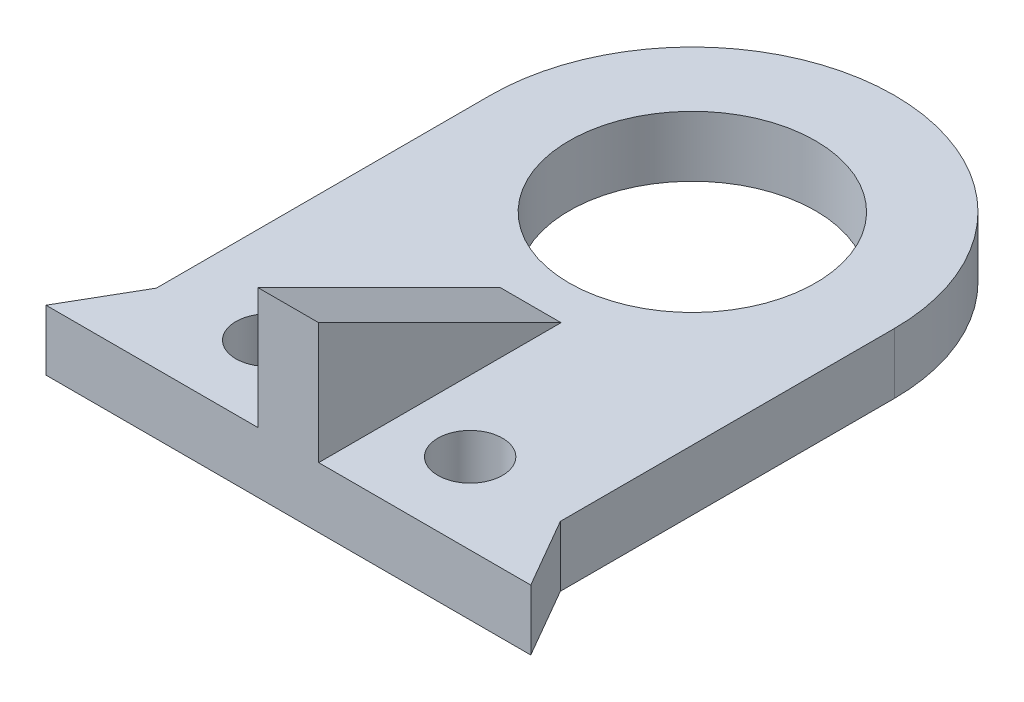
ISO-10303-21;
HEADER;
FILE_DESCRIPTION(('STEP AP214'),'2;1');
FILE_NAME('part.step','',(''),(''),'','','');
FILE_SCHEMA(('AUTOMOTIVE_DESIGN { 1 0 10303 214 1 1 1 1 }'));
ENDSEC;
DATA;
#1=APPLICATION_CONTEXT('core data for automotive mechanical design processes');
#2=APPLICATION_PROTOCOL_DEFINITION('international standard','automotive_design',2000,#1);
#3=PRODUCT_CONTEXT('',#1,'mechanical');
#4=PRODUCT('Part','Part','',(#3));
#5=PRODUCT_RELATED_PRODUCT_CATEGORY('part','',(#4));
#6=PRODUCT_DEFINITION_FORMATION('','',#4);
#7=PRODUCT_DEFINITION_CONTEXT('part definition',#1,'design');
#8=PRODUCT_DEFINITION('design','',#6,#7);
#9=PRODUCT_DEFINITION_SHAPE('','',#8);
#10=(LENGTH_UNIT() NAMED_UNIT(*) SI_UNIT(.MILLI.,.METRE.));
#11=(NAMED_UNIT(*) PLANE_ANGLE_UNIT() SI_UNIT($,.RADIAN.));
#12=(NAMED_UNIT(*) SI_UNIT($,.STERADIAN.) SOLID_ANGLE_UNIT());
#13=UNCERTAINTY_MEASURE_WITH_UNIT(LENGTH_MEASURE(1.E-05),#10,'distance_accuracy_value','');
#14=(GEOMETRIC_REPRESENTATION_CONTEXT(3) GLOBAL_UNCERTAINTY_ASSIGNED_CONTEXT((#13)) GLOBAL_UNIT_ASSIGNED_CONTEXT((#10,
#11,#12)) REPRESENTATION_CONTEXT('',''));
#15=CARTESIAN_POINT('',(0.,0.,0.));
#16=DIRECTION('',(0.,0.,1.));
#17=DIRECTION('',(1.,0.,0.));
#18=AXIS2_PLACEMENT_3D('',#15,#16,#17);
#19=CARTESIAN_POINT('',(10.,3.,10.));
#20=DIRECTION('',(-1.,0.,0.));
#21=DIRECTION('',(0.,0.,1.));
#22=AXIS2_PLACEMENT_3D('',#19,#20,#21);
#23=PLANE('',#22);
#24=DIRECTION('',(0.,-1.,0.));
#25=VECTOR('',#24,1.);
#26=CARTESIAN_POINT('',(10.,3.,6.53589838486228));
#27=LINE('',#26,#25);
#28=CARTESIAN_POINT('',(10.,3.,6.53589838486228));
#29=VERTEX_POINT('',#28);
#30=CARTESIAN_POINT('',(10.,0.,6.53589838486228));
#31=VERTEX_POINT('',#30);
#32=EDGE_CURVE('E125',#29,#31,#27,.T.);
#33=ORIENTED_EDGE('',*,*,#32,.T.);
#34=DIRECTION('',(0.,0.,-1.));
#35=VECTOR('',#34,1.);
#36=CARTESIAN_POINT('',(10.,0.,10.));
#37=LINE('',#36,#35);
#38=CARTESIAN_POINT('',(10.,0.,-10.));
#39=VERTEX_POINT('',#38);
#40=EDGE_CURVE('E182',#31,#39,#37,.T.);
#41=ORIENTED_EDGE('',*,*,#40,.T.);
#42=DIRECTION('',(0.,-1.,0.));
#43=VECTOR('',#42,1.);
#44=CARTESIAN_POINT('',(10.,3.,-10.));
#45=LINE('',#44,#43);
#46=CARTESIAN_POINT('',(10.,3.,-10.));
#47=VERTEX_POINT('',#46);
#48=EDGE_CURVE('E40',#47,#39,#45,.T.);
#49=ORIENTED_EDGE('',*,*,#48,.F.);
#50=DIRECTION('',(0.,0.,-1.));
#51=VECTOR('',#50,1.);
#52=CARTESIAN_POINT('',(10.,3.,10.));
#53=LINE('',#52,#51);
#54=EDGE_CURVE('E47',#29,#47,#53,.T.);
#55=ORIENTED_EDGE('',*,*,#54,.F.);
#56=EDGE_LOOP('',(#33,#41,#49,#55));
#57=FACE_BOUND('',#56,.T.);
#58=ADVANCED_FACE('F32',(#57),#23,.F.);
#59=CARTESIAN_POINT('',(-10.,3.,10.));
#60=DIRECTION('',(1.,0.,0.));
#61=DIRECTION('',(0.,0.,-1.));
#62=AXIS2_PLACEMENT_3D('',#59,#60,#61);
#63=PLANE('',#62);
#64=DIRECTION('',(0.,-1.,0.));
#65=VECTOR('',#64,1.);
#66=CARTESIAN_POINT('',(-10.,3.,6.53589838486228));
#67=LINE('',#66,#65);
#68=CARTESIAN_POINT('',(-10.,3.,6.53589838486228));
#69=VERTEX_POINT('',#68);
#70=CARTESIAN_POINT('',(-10.,0.,6.53589838486228));
#71=VERTEX_POINT('',#70);
#72=EDGE_CURVE('E140',#69,#71,#67,.T.);
#73=ORIENTED_EDGE('',*,*,#72,.F.);
#74=DIRECTION('',(0.,0.,1.));
#75=VECTOR('',#74,1.);
#76=CARTESIAN_POINT('',(-10.,3.,10.));
#77=LINE('',#76,#75);
#78=CARTESIAN_POINT('',(-10.,3.,-10.));
#79=VERTEX_POINT('',#78);
#80=EDGE_CURVE('E114',#79,#69,#77,.T.);
#81=ORIENTED_EDGE('',*,*,#80,.F.);
#82=DIRECTION('',(0.,-1.,0.));
#83=VECTOR('',#82,1.);
#84=CARTESIAN_POINT('',(-10.,3.,-10.));
#85=LINE('',#84,#83);
#86=CARTESIAN_POINT('',(-10.,0.,-10.));
#87=VERTEX_POINT('',#86);
#88=EDGE_CURVE('E11',#79,#87,#85,.T.);
#89=ORIENTED_EDGE('',*,*,#88,.T.);
#90=DIRECTION('',(0.,0.,1.));
#91=VECTOR('',#90,1.);
#92=CARTESIAN_POINT('',(-10.,0.,10.));
#93=LINE('',#92,#91);
#94=EDGE_CURVE('E188',#87,#71,#93,.T.);
#95=ORIENTED_EDGE('',*,*,#94,.T.);
#96=EDGE_LOOP('',(#73,#81,#89,#95));
#97=FACE_BOUND('',#96,.T.);
#98=ADVANCED_FACE('F202',(#97),#63,.F.);
#99=CARTESIAN_POINT('',(0.,3.,-10.));
#100=DIRECTION('',(0.,1.,0.));
#101=DIRECTION('',(0.,0.,1.));
#102=AXIS2_PLACEMENT_3D('',#99,#100,#101);
#103=PLANE('',#102);
#104=CARTESIAN_POINT('',(-5.,3.,6.));
#105=DIRECTION('',(0.,1.,0.));
#106=DIRECTION('',(0.,0.,1.));
#107=AXIS2_PLACEMENT_3D('',#104,#105,#106);
#108=CIRCLE('',#107,1.6);
#109=CARTESIAN_POINT('',(-5.,3.,7.6));
#110=VERTEX_POINT('',#109);
#111=EDGE_CURVE('E165',#110,#110,#108,.T.);
#112=ORIENTED_EDGE('',*,*,#111,.F.);
#113=EDGE_LOOP('',(#112));
#114=FACE_BOUND('',#113,.T.);
#115=CARTESIAN_POINT('',(5.,3.,6.));
#116=DIRECTION('',(0.,1.,0.));
#117=DIRECTION('',(0.,0.,1.));
#118=AXIS2_PLACEMENT_3D('',#115,#116,#117);
#119=CIRCLE('',#118,1.6);
#120=CARTESIAN_POINT('',(5.,3.,7.6));
#121=VERTEX_POINT('',#120);
#122=EDGE_CURVE('E160',#121,#121,#119,.T.);
#123=ORIENTED_EDGE('',*,*,#122,.F.);
#124=EDGE_LOOP('',(#123));
#125=FACE_BOUND('',#124,.T.);
#126=CARTESIAN_POINT('',(0.,3.,-10.));
#127=DIRECTION('',(0.,1.,0.));
#128=DIRECTION('',(0.,0.,1.));
#129=AXIS2_PLACEMENT_3D('',#126,#127,#128);
#130=CIRCLE('',#129,6.1);
#131=CARTESIAN_POINT('',(0.,3.,-3.9));
#132=VERTEX_POINT('',#131);
#133=EDGE_CURVE('E173',#132,#132,#130,.T.);
#134=ORIENTED_EDGE('',*,*,#133,.F.);
#135=EDGE_LOOP('',(#134));
#136=FACE_BOUND('',#135,.T.);
#137=DIRECTION('',(1.,0.,0.));
#138=VECTOR('',#137,1.);
#139=CARTESIAN_POINT('',(-10.,3.,10.));
#140=LINE('',#139,#138);
#141=CARTESIAN_POINT('',(-12.,3.,10.));
#142=VERTEX_POINT('',#141);
#143=CARTESIAN_POINT('',(-1.5,3.,10.));
#144=VERTEX_POINT('',#143);
#145=EDGE_CURVE('E113',#142,#144,#140,.T.);
#146=ORIENTED_EDGE('',*,*,#145,.T.);
#147=DIRECTION('',(0.,0.,-1.));
#148=VECTOR('',#147,1.);
#149=CARTESIAN_POINT('',(-1.5,3.,10.));
#150=LINE('',#149,#148);
#151=CARTESIAN_POINT('',(-1.5,3.,-2.));
#152=VERTEX_POINT('',#151);
#153=EDGE_CURVE('E55',#144,#152,#150,.T.);
#154=ORIENTED_EDGE('',*,*,#153,.T.);
#155=DIRECTION('',(-1.,0.,0.));
#156=VECTOR('',#155,1.);
#157=CARTESIAN_POINT('',(1.5,3.,-2.));
#158=LINE('',#157,#156);
#159=CARTESIAN_POINT('',(1.5,3.,-2.));
#160=VERTEX_POINT('',#159);
#161=EDGE_CURVE('E157',#160,#152,#158,.T.);
#162=ORIENTED_EDGE('',*,*,#161,.F.);
#163=DIRECTION('',(0.,0.,-1.));
#164=VECTOR('',#163,1.);
#165=CARTESIAN_POINT('',(1.5,3.,10.));
#166=LINE('',#165,#164);
#167=CARTESIAN_POINT('',(1.5,3.,10.));
#168=VERTEX_POINT('',#167);
#169=EDGE_CURVE('E109',#168,#160,#166,.T.);
#170=ORIENTED_EDGE('',*,*,#169,.F.);
#171=CARTESIAN_POINT('',(12.,3.,10.));
#172=VERTEX_POINT('',#171);
#173=EDGE_CURVE('E102',#168,#172,#140,.T.);
#174=ORIENTED_EDGE('',*,*,#173,.T.);
#175=DIRECTION('',(-0.500000000000004,0.,-0.866025403784436));
#176=VECTOR('',#175,1.);
#177=CARTESIAN_POINT('',(12.,3.,10.));
#178=LINE('',#177,#176);
#179=EDGE_CURVE('E106',#172,#29,#178,.T.);
#180=ORIENTED_EDGE('',*,*,#179,.T.);
#181=ORIENTED_EDGE('',*,*,#54,.T.);
#182=CARTESIAN_POINT('',(0.,3.,-10.));
#183=DIRECTION('',(0.,1.,0.));
#184=DIRECTION('',(0.,0.,1.));
#185=AXIS2_PLACEMENT_3D('',#182,#183,#184);
#186=CIRCLE('',#185,10.);
#187=EDGE_CURVE('E179',#47,#79,#186,.T.);
#188=ORIENTED_EDGE('',*,*,#187,.T.);
#189=ORIENTED_EDGE('',*,*,#80,.T.);
#190=DIRECTION('',(-0.500000000000004,0.,0.866025403784436));
#191=VECTOR('',#190,1.);
#192=CARTESIAN_POINT('',(-12.,3.,10.));
#193=LINE('',#192,#191);
#194=EDGE_CURVE('E133',#69,#142,#193,.T.);
#195=ORIENTED_EDGE('',*,*,#194,.T.);
#196=EDGE_LOOP('',(#146,#154,#162,#170,#174,#180,#181,#188,#189,#195));
#197=FACE_BOUND('',#196,.T.);
#198=ADVANCED_FACE('F104',(#114,#125,#136,#197),#103,.T.);
#199=CARTESIAN_POINT('',(0.,0.,-10.));
#200=DIRECTION('',(0.,1.,0.));
#201=DIRECTION('',(0.,0.,1.));
#202=AXIS2_PLACEMENT_3D('',#199,#200,#201);
#203=PLANE('',#202);
#204=CARTESIAN_POINT('',(-5.,0.,6.));
#205=DIRECTION('',(0.,1.,0.));
#206=DIRECTION('',(0.,0.,1.));
#207=AXIS2_PLACEMENT_3D('',#204,#205,#206);
#208=CIRCLE('',#207,1.6);
#209=CARTESIAN_POINT('',(-5.,0.,7.6));
#210=VERTEX_POINT('',#209);
#211=EDGE_CURVE('E161',#210,#210,#208,.T.);
#212=ORIENTED_EDGE('',*,*,#211,.T.);
#213=EDGE_LOOP('',(#212));
#214=FACE_BOUND('',#213,.T.);
#215=CARTESIAN_POINT('',(5.,0.,6.));
#216=DIRECTION('',(0.,1.,0.));
#217=DIRECTION('',(0.,0.,1.));
#218=AXIS2_PLACEMENT_3D('',#215,#216,#217);
#219=CIRCLE('',#218,1.6);
#220=CARTESIAN_POINT('',(5.,0.,7.6));
#221=VERTEX_POINT('',#220);
#222=EDGE_CURVE('E168',#221,#221,#219,.T.);
#223=ORIENTED_EDGE('',*,*,#222,.T.);
#224=EDGE_LOOP('',(#223));
#225=FACE_BOUND('',#224,.T.);
#226=CARTESIAN_POINT('',(0.,0.,-10.));
#227=DIRECTION('',(0.,1.,0.));
#228=DIRECTION('',(0.,0.,1.));
#229=AXIS2_PLACEMENT_3D('',#226,#227,#228);
#230=CIRCLE('',#229,10.);
#231=EDGE_CURVE('E176',#39,#87,#230,.T.);
#232=ORIENTED_EDGE('',*,*,#231,.F.);
#233=ORIENTED_EDGE('',*,*,#40,.F.);
#234=DIRECTION('',(-0.500000000000004,0.,-0.866025403784436));
#235=VECTOR('',#234,1.);
#236=CARTESIAN_POINT('',(12.,0.,10.));
#237=LINE('',#236,#235);
#238=CARTESIAN_POINT('',(12.,0.,10.));
#239=VERTEX_POINT('',#238);
#240=EDGE_CURVE('E128',#239,#31,#237,.T.);
#241=ORIENTED_EDGE('',*,*,#240,.F.);
#242=DIRECTION('',(1.,0.,0.));
#243=VECTOR('',#242,1.);
#244=CARTESIAN_POINT('',(-10.,0.,10.));
#245=LINE('',#244,#243);
#246=CARTESIAN_POINT('',(-12.,0.,10.));
#247=VERTEX_POINT('',#246);
#248=EDGE_CURVE('E120',#247,#239,#245,.T.);
#249=ORIENTED_EDGE('',*,*,#248,.F.);
#250=DIRECTION('',(-0.500000000000004,0.,0.866025403784436));
#251=VECTOR('',#250,1.);
#252=CARTESIAN_POINT('',(-12.,0.,10.));
#253=LINE('',#252,#251);
#254=EDGE_CURVE('E124',#71,#247,#253,.T.);
#255=ORIENTED_EDGE('',*,*,#254,.F.);
#256=ORIENTED_EDGE('',*,*,#94,.F.);
#257=EDGE_LOOP('',(#232,#233,#241,#249,#255,#256));
#258=FACE_BOUND('',#257,.T.);
#259=CARTESIAN_POINT('',(0.,0.,-10.));
#260=DIRECTION('',(0.,1.,0.));
#261=DIRECTION('',(0.,0.,1.));
#262=AXIS2_PLACEMENT_3D('',#259,#260,#261);
#263=CIRCLE('',#262,6.1);
#264=CARTESIAN_POINT('',(0.,0.,-3.9));
#265=VERTEX_POINT('',#264);
#266=EDGE_CURVE('E164',#265,#265,#263,.T.);
#267=ORIENTED_EDGE('',*,*,#266,.T.);
#268=EDGE_LOOP('',(#267));
#269=FACE_BOUND('',#268,.T.);
#270=ADVANCED_FACE('F198',(#214,#225,#258,#269),#203,.F.);
#271=CARTESIAN_POINT('',(0.,3.,-10.));
#272=DIRECTION('',(0.,-1.,0.));
#273=DIRECTION('',(0.,0.,-1.));
#274=AXIS2_PLACEMENT_3D('',#271,#272,#273);
#275=CYLINDRICAL_SURFACE('',#274,10.);
#276=ORIENTED_EDGE('',*,*,#231,.T.);
#277=ORIENTED_EDGE('',*,*,#88,.F.);
#278=ORIENTED_EDGE('',*,*,#187,.F.);
#279=ORIENTED_EDGE('',*,*,#48,.T.);
#280=EDGE_LOOP('',(#276,#277,#278,#279));
#281=FACE_BOUND('',#280,.T.);
#282=ADVANCED_FACE('F34',(#281),#275,.T.);
#283=CARTESIAN_POINT('',(-10.,3.,10.));
#284=DIRECTION('',(0.,0.,-1.));
#285=DIRECTION('',(-1.,0.,0.));
#286=AXIS2_PLACEMENT_3D('',#283,#284,#285);
#287=PLANE('',#286);
#288=ORIENTED_EDGE('',*,*,#248,.T.);
#289=DIRECTION('',(0.,-1.,0.));
#290=VECTOR('',#289,1.);
#291=CARTESIAN_POINT('',(12.,3.,10.));
#292=LINE('',#291,#290);
#293=EDGE_CURVE('E117',#172,#239,#292,.T.);
#294=ORIENTED_EDGE('',*,*,#293,.F.);
#295=ORIENTED_EDGE('',*,*,#173,.F.);
#296=DIRECTION('',(0.,-1.,0.));
#297=VECTOR('',#296,1.);
#298=CARTESIAN_POINT('',(1.5,3.,10.));
#299=LINE('',#298,#297);
#300=CARTESIAN_POINT('',(1.5,9.,10.));
#301=VERTEX_POINT('',#300);
#302=EDGE_CURVE('E147',#301,#168,#299,.T.);
#303=ORIENTED_EDGE('',*,*,#302,.F.);
#304=DIRECTION('',(-1.,0.,0.));
#305=VECTOR('',#304,1.);
#306=CARTESIAN_POINT('',(1.5,9.,10.));
#307=LINE('',#306,#305);
#308=CARTESIAN_POINT('',(-1.5,9.,10.));
#309=VERTEX_POINT('',#308);
#310=EDGE_CURVE('E149',#301,#309,#307,.T.);
#311=ORIENTED_EDGE('',*,*,#310,.T.);
#312=DIRECTION('',(0.,-1.,0.));
#313=VECTOR('',#312,1.);
#314=CARTESIAN_POINT('',(-1.5,3.,10.));
#315=LINE('',#314,#313);
#316=EDGE_CURVE('E145',#309,#144,#315,.T.);
#317=ORIENTED_EDGE('',*,*,#316,.T.);
#318=ORIENTED_EDGE('',*,*,#145,.F.);
#319=DIRECTION('',(0.,-1.,0.));
#320=VECTOR('',#319,1.);
#321=CARTESIAN_POINT('',(-12.,3.,10.));
#322=LINE('',#321,#320);
#323=EDGE_CURVE('E136',#142,#247,#322,.T.);
#324=ORIENTED_EDGE('',*,*,#323,.T.);
#325=EDGE_LOOP('',(#288,#294,#295,#303,#311,#317,#318,#324));
#326=FACE_BOUND('',#325,.T.);
#327=ADVANCED_FACE('F118',(#326),#287,.F.);
#328=CARTESIAN_POINT('',(0.,3.,-10.));
#329=DIRECTION('',(0.,-1.,0.));
#330=DIRECTION('',(0.,0.,-1.));
#331=AXIS2_PLACEMENT_3D('',#328,#329,#330);
#332=CYLINDRICAL_SURFACE('',#331,6.1);
#333=ORIENTED_EDGE('',*,*,#133,.T.);
#334=EDGE_LOOP('',(#333));
#335=FACE_BOUND('',#334,.T.);
#336=ORIENTED_EDGE('',*,*,#266,.F.);
#337=EDGE_LOOP('',(#336));
#338=FACE_BOUND('',#337,.T.);
#339=ADVANCED_FACE('F234',(#335,#338),#332,.F.);
#340=CARTESIAN_POINT('',(5.,0.,6.));
#341=DIRECTION('',(0.,1.,0.));
#342=DIRECTION('',(0.,0.,1.));
#343=AXIS2_PLACEMENT_3D('',#340,#341,#342);
#344=CYLINDRICAL_SURFACE('',#343,1.6);
#345=ORIENTED_EDGE('',*,*,#222,.F.);
#346=EDGE_LOOP('',(#345));
#347=FACE_BOUND('',#346,.T.);
#348=ORIENTED_EDGE('',*,*,#122,.T.);
#349=EDGE_LOOP('',(#348));
#350=FACE_BOUND('',#349,.T.);
#351=ADVANCED_FACE('F239',(#347,#350),#344,.F.);
#352=CARTESIAN_POINT('',(-5.,0.,6.));
#353=DIRECTION('',(0.,1.,0.));
#354=DIRECTION('',(0.,0.,1.));
#355=AXIS2_PLACEMENT_3D('',#352,#353,#354);
#356=CYLINDRICAL_SURFACE('',#355,1.6);
#357=ORIENTED_EDGE('',*,*,#211,.F.);
#358=EDGE_LOOP('',(#357));
#359=FACE_BOUND('',#358,.T.);
#360=ORIENTED_EDGE('',*,*,#111,.T.);
#361=EDGE_LOOP('',(#360));
#362=FACE_BOUND('',#361,.T.);
#363=ADVANCED_FACE('F222',(#359,#362),#356,.F.);
#364=CARTESIAN_POINT('',(1.5,9.,10.));
#365=DIRECTION('',(0.,-0.894427190999916,0.447213595499958));
#366=DIRECTION('',(0.,-0.447213595499958,-0.894427190999916));
#367=AXIS2_PLACEMENT_3D('',#364,#365,#366);
#368=PLANE('',#367);
#369=DIRECTION('',(0.,0.447213595499958,0.894427190999916));
#370=VECTOR('',#369,1.);
#371=CARTESIAN_POINT('',(-1.5,9.,10.));
#372=LINE('',#371,#370);
#373=EDGE_CURVE('E151',#152,#309,#372,.T.);
#374=ORIENTED_EDGE('',*,*,#373,.T.);
#375=ORIENTED_EDGE('',*,*,#310,.F.);
#376=DIRECTION('',(0.,0.447213595499958,0.894427190999916));
#377=VECTOR('',#376,1.);
#378=CARTESIAN_POINT('',(1.5,9.,10.));
#379=LINE('',#378,#377);
#380=EDGE_CURVE('E144',#160,#301,#379,.T.);
#381=ORIENTED_EDGE('',*,*,#380,.F.);
#382=ORIENTED_EDGE('',*,*,#161,.T.);
#383=EDGE_LOOP('',(#374,#375,#381,#382));
#384=FACE_BOUND('',#383,.T.);
#385=ADVANCED_FACE('F212',(#384),#368,.F.);
#386=CARTESIAN_POINT('',(1.5,0.,0.));
#387=DIRECTION('',(1.,0.,0.));
#388=DIRECTION('',(0.,0.,-1.));
#389=AXIS2_PLACEMENT_3D('',#386,#387,#388);
#390=PLANE('',#389);
#391=ORIENTED_EDGE('',*,*,#169,.T.);
#392=ORIENTED_EDGE('',*,*,#380,.T.);
#393=ORIENTED_EDGE('',*,*,#302,.T.);
#394=EDGE_LOOP('',(#391,#392,#393));
#395=FACE_BOUND('',#394,.T.);
#396=ADVANCED_FACE('F214',(#395),#390,.T.);
#397=CARTESIAN_POINT('',(-1.5,0.,0.));
#398=DIRECTION('',(1.,0.,0.));
#399=DIRECTION('',(0.,0.,-1.));
#400=AXIS2_PLACEMENT_3D('',#397,#398,#399);
#401=PLANE('',#400);
#402=ORIENTED_EDGE('',*,*,#153,.F.);
#403=ORIENTED_EDGE('',*,*,#316,.F.);
#404=ORIENTED_EDGE('',*,*,#373,.F.);
#405=EDGE_LOOP('',(#402,#403,#404));
#406=FACE_BOUND('',#405,.T.);
#407=ADVANCED_FACE('F209',(#406),#401,.F.);
#408=CARTESIAN_POINT('',(-12.,3.,10.));
#409=DIRECTION('',(0.866025403784436,0.,0.500000000000004));
#410=DIRECTION('',(0.500000000000004,0.,-0.866025403784437));
#411=AXIS2_PLACEMENT_3D('',#408,#409,#410);
#412=PLANE('',#411);
#413=ORIENTED_EDGE('',*,*,#254,.T.);
#414=ORIENTED_EDGE('',*,*,#323,.F.);
#415=ORIENTED_EDGE('',*,*,#194,.F.);
#416=ORIENTED_EDGE('',*,*,#72,.T.);
#417=EDGE_LOOP('',(#413,#414,#415,#416));
#418=FACE_BOUND('',#417,.T.);
#419=ADVANCED_FACE('F205',(#418),#412,.F.);
#420=CARTESIAN_POINT('',(12.,3.,10.));
#421=DIRECTION('',(-0.866025403784436,0.,0.500000000000004));
#422=DIRECTION('',(0.500000000000004,0.,0.866025403784436));
#423=AXIS2_PLACEMENT_3D('',#420,#421,#422);
#424=PLANE('',#423);
#425=ORIENTED_EDGE('',*,*,#240,.T.);
#426=ORIENTED_EDGE('',*,*,#32,.F.);
#427=ORIENTED_EDGE('',*,*,#179,.F.);
#428=ORIENTED_EDGE('',*,*,#293,.T.);
#429=EDGE_LOOP('',(#425,#426,#427,#428));
#430=FACE_BOUND('',#429,.T.);
#431=ADVANCED_FACE('F127',(#430),#424,.F.);
#432=CLOSED_SHELL('',(#58,#98,#198,#270,#282,#327,#339,#351,#363,#385,#396,#407,#419,#431));
#433=MANIFOLD_SOLID_BREP('B2',#432);
#434=ADVANCED_BREP_SHAPE_REPRESENTATION('',(#18,#433),#14);
#435=SHAPE_DEFINITION_REPRESENTATION(#9,#434);
ENDSEC;
END-ISO-10303-21;
